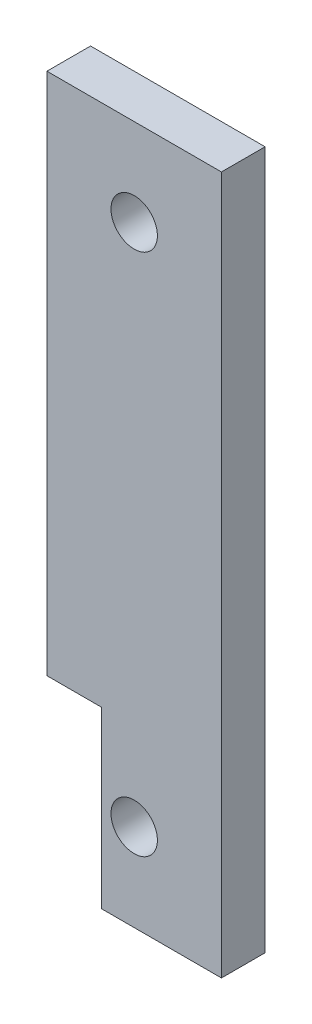
ISO-10303-21;
HEADER;
FILE_DESCRIPTION(('STEP AP214'),'2;1');
FILE_NAME('part.step','',(''),(''),'','','');
FILE_SCHEMA(('AUTOMOTIVE_DESIGN { 1 0 10303 214 1 1 1 1 }'));
ENDSEC;
DATA;
#1=APPLICATION_CONTEXT('core data for automotive mechanical design processes');
#2=APPLICATION_PROTOCOL_DEFINITION('international standard','automotive_design',2000,#1);
#3=PRODUCT_CONTEXT('',#1,'mechanical');
#4=PRODUCT('Part','Part','',(#3));
#5=PRODUCT_RELATED_PRODUCT_CATEGORY('part','',(#4));
#6=PRODUCT_DEFINITION_FORMATION('','',#4);
#7=PRODUCT_DEFINITION_CONTEXT('part definition',#1,'design');
#8=PRODUCT_DEFINITION('design','',#6,#7);
#9=PRODUCT_DEFINITION_SHAPE('','',#8);
#10=(LENGTH_UNIT() NAMED_UNIT(*) SI_UNIT(.MILLI.,.METRE.));
#11=(NAMED_UNIT(*) PLANE_ANGLE_UNIT() SI_UNIT($,.RADIAN.));
#12=(NAMED_UNIT(*) SI_UNIT($,.STERADIAN.) SOLID_ANGLE_UNIT());
#13=UNCERTAINTY_MEASURE_WITH_UNIT(LENGTH_MEASURE(1.E-05),#10,'distance_accuracy_value','');
#14=(GEOMETRIC_REPRESENTATION_CONTEXT(3) GLOBAL_UNCERTAINTY_ASSIGNED_CONTEXT((#13)) GLOBAL_UNIT_ASSIGNED_CONTEXT((#10,
#11,#12)) REPRESENTATION_CONTEXT('',''));
#15=CARTESIAN_POINT('',(0.,0.,0.));
#16=DIRECTION('',(0.,0.,1.));
#17=DIRECTION('',(1.,0.,0.));
#18=AXIS2_PLACEMENT_3D('',#15,#16,#17);
#19=CARTESIAN_POINT('',(0.,101.6,0.));
#20=DIRECTION('',(1.,0.,0.));
#21=DIRECTION('',(0.,0.,-1.));
#22=AXIS2_PLACEMENT_3D('',#19,#20,#21);
#23=PLANE('',#22);
#24=DIRECTION('',(0.,-1.,0.));
#25=VECTOR('',#24,1.);
#26=CARTESIAN_POINT('',(0.,101.6,-6.35));
#27=LINE('',#26,#25);
#28=CARTESIAN_POINT('',(0.,101.6,-6.35));
#29=VERTEX_POINT('',#28);
#30=CARTESIAN_POINT('',(0.,25.4,-6.35));
#31=VERTEX_POINT('',#30);
#32=EDGE_CURVE('E110',#29,#31,#27,.T.);
#33=ORIENTED_EDGE('',*,*,#32,.T.);
#34=DIRECTION('',(0.,0.,-1.));
#35=VECTOR('',#34,1.);
#36=CARTESIAN_POINT('',(0.,25.4,0.));
#37=LINE('',#36,#35);
#38=CARTESIAN_POINT('',(0.,25.4,0.));
#39=VERTEX_POINT('',#38);
#40=EDGE_CURVE('E99',#39,#31,#37,.T.);
#41=ORIENTED_EDGE('',*,*,#40,.F.);
#42=DIRECTION('',(0.,-1.,0.));
#43=VECTOR('',#42,1.);
#44=CARTESIAN_POINT('',(0.,101.6,0.));
#45=LINE('',#44,#43);
#46=CARTESIAN_POINT('',(0.,101.6,0.));
#47=VERTEX_POINT('',#46);
#48=EDGE_CURVE('E11',#47,#39,#45,.T.);
#49=ORIENTED_EDGE('',*,*,#48,.F.);
#50=DIRECTION('',(0.,0.,1.));
#51=VECTOR('',#50,1.);
#52=CARTESIAN_POINT('',(0.,101.6,0.));
#53=LINE('',#52,#51);
#54=EDGE_CURVE('E224',#29,#47,#53,.T.);
#55=ORIENTED_EDGE('',*,*,#54,.F.);
#56=EDGE_LOOP('',(#33,#41,#49,#55));
#57=FACE_BOUND('',#56,.T.);
#58=ADVANCED_FACE('F34',(#57),#23,.F.);
#59=CARTESIAN_POINT('',(0.,101.6,0.));
#60=DIRECTION('',(0.,0.,-1.));
#61=DIRECTION('',(-1.,0.,0.));
#62=AXIS2_PLACEMENT_3D('',#59,#60,#61);
#63=PLANE('',#62);
#64=CARTESIAN_POINT('',(12.7,88.9,0.));
#65=DIRECTION('',(0.,0.,1.));
#66=DIRECTION('',(1.,0.,0.));
#67=AXIS2_PLACEMENT_3D('',#64,#65,#66);
#68=CIRCLE('',#67,3.3782);
#69=CARTESIAN_POINT('',(16.0782,88.9,0.));
#70=VERTEX_POINT('',#69);
#71=EDGE_CURVE('E210',#70,#70,#68,.T.);
#72=ORIENTED_EDGE('',*,*,#71,.F.);
#73=EDGE_LOOP('',(#72));
#74=FACE_BOUND('',#73,.T.);
#75=CARTESIAN_POINT('',(12.7,12.7,0.));
#76=DIRECTION('',(0.,0.,1.));
#77=DIRECTION('',(1.,0.,0.));
#78=AXIS2_PLACEMENT_3D('',#75,#76,#77);
#79=CIRCLE('',#78,3.3782);
#80=CARTESIAN_POINT('',(16.0782,12.7,0.));
#81=VERTEX_POINT('',#80);
#82=EDGE_CURVE('E213',#81,#81,#79,.T.);
#83=ORIENTED_EDGE('',*,*,#82,.F.);
#84=EDGE_LOOP('',(#83));
#85=FACE_BOUND('',#84,.T.);
#86=DIRECTION('',(1.,0.,0.));
#87=VECTOR('',#86,1.);
#88=CARTESIAN_POINT('',(0.,25.4,0.));
#89=LINE('',#88,#87);
#90=CARTESIAN_POINT('',(7.9375,25.4,0.));
#91=VERTEX_POINT('',#90);
#92=EDGE_CURVE('E95',#39,#91,#89,.T.);
#93=ORIENTED_EDGE('',*,*,#92,.T.);
#94=DIRECTION('',(0.,-1.,0.));
#95=VECTOR('',#94,1.);
#96=CARTESIAN_POINT('',(7.9375,0.,0.));
#97=LINE('',#96,#95);
#98=CARTESIAN_POINT('',(7.9375,0.,0.));
#99=VERTEX_POINT('',#98);
#100=EDGE_CURVE('E104',#91,#99,#97,.T.);
#101=ORIENTED_EDGE('',*,*,#100,.T.);
#102=DIRECTION('',(1.,0.,0.));
#103=VECTOR('',#102,1.);
#104=CARTESIAN_POINT('',(0.,0.,0.));
#105=LINE('',#104,#103);
#106=CARTESIAN_POINT('',(25.4,0.,0.));
#107=VERTEX_POINT('',#106);
#108=EDGE_CURVE('E223',#99,#107,#105,.T.);
#109=ORIENTED_EDGE('',*,*,#108,.T.);
#110=DIRECTION('',(0.,-1.,0.));
#111=VECTOR('',#110,1.);
#112=CARTESIAN_POINT('',(25.4,101.6,0.));
#113=LINE('',#112,#111);
#114=CARTESIAN_POINT('',(25.4,101.6,0.));
#115=VERTEX_POINT('',#114);
#116=EDGE_CURVE('E41',#115,#107,#113,.T.);
#117=ORIENTED_EDGE('',*,*,#116,.F.);
#118=DIRECTION('',(1.,0.,0.));
#119=VECTOR('',#118,1.);
#120=CARTESIAN_POINT('',(0.,101.6,0.));
#121=LINE('',#120,#119);
#122=EDGE_CURVE('E80',#47,#115,#121,.T.);
#123=ORIENTED_EDGE('',*,*,#122,.F.);
#124=ORIENTED_EDGE('',*,*,#48,.T.);
#125=EDGE_LOOP('',(#93,#101,#109,#117,#123,#124));
#126=FACE_BOUND('',#125,.T.);
#127=ADVANCED_FACE('F112',(#74,#85,#126),#63,.F.);
#128=CARTESIAN_POINT('',(25.4,101.6,0.));
#129=DIRECTION('',(-1.,0.,0.));
#130=DIRECTION('',(0.,0.,1.));
#131=AXIS2_PLACEMENT_3D('',#128,#129,#130);
#132=PLANE('',#131);
#133=DIRECTION('',(0.,0.,-1.));
#134=VECTOR('',#133,1.);
#135=CARTESIAN_POINT('',(25.4,0.,0.));
#136=LINE('',#135,#134);
#137=CARTESIAN_POINT('',(25.4,0.,-6.35));
#138=VERTEX_POINT('',#137);
#139=EDGE_CURVE('E73',#107,#138,#136,.T.);
#140=ORIENTED_EDGE('',*,*,#139,.T.);
#141=DIRECTION('',(0.,-1.,0.));
#142=VECTOR('',#141,1.);
#143=CARTESIAN_POINT('',(25.4,101.6,-6.35));
#144=LINE('',#143,#142);
#145=CARTESIAN_POINT('',(25.4,101.6,-6.35));
#146=VERTEX_POINT('',#145);
#147=EDGE_CURVE('E236',#146,#138,#144,.T.);
#148=ORIENTED_EDGE('',*,*,#147,.F.);
#149=DIRECTION('',(0.,0.,-1.));
#150=VECTOR('',#149,1.);
#151=CARTESIAN_POINT('',(25.4,101.6,0.));
#152=LINE('',#151,#150);
#153=EDGE_CURVE('E228',#115,#146,#152,.T.);
#154=ORIENTED_EDGE('',*,*,#153,.F.);
#155=ORIENTED_EDGE('',*,*,#116,.T.);
#156=EDGE_LOOP('',(#140,#148,#154,#155));
#157=FACE_BOUND('',#156,.T.);
#158=ADVANCED_FACE('F114',(#157),#132,.F.);
#159=CARTESIAN_POINT('',(0.,101.6,-6.35));
#160=DIRECTION('',(0.,0.,1.));
#161=DIRECTION('',(1.,0.,0.));
#162=AXIS2_PLACEMENT_3D('',#159,#160,#161);
#163=PLANE('',#162);
#164=CARTESIAN_POINT('',(12.7,88.9,-6.35));
#165=DIRECTION('',(0.,0.,1.));
#166=DIRECTION('',(1.,0.,0.));
#167=AXIS2_PLACEMENT_3D('',#164,#165,#166);
#168=CIRCLE('',#167,3.3782);
#169=CARTESIAN_POINT('',(16.0782,88.9,-6.35));
#170=VERTEX_POINT('',#169);
#171=EDGE_CURVE('E208',#170,#170,#168,.T.);
#172=ORIENTED_EDGE('',*,*,#171,.T.);
#173=EDGE_LOOP('',(#172));
#174=FACE_BOUND('',#173,.T.);
#175=CARTESIAN_POINT('',(12.7,12.7,-6.35));
#176=DIRECTION('',(0.,0.,1.));
#177=DIRECTION('',(1.,0.,0.));
#178=AXIS2_PLACEMENT_3D('',#175,#176,#177);
#179=CIRCLE('',#178,3.3782);
#180=CARTESIAN_POINT('',(16.0782,12.7,-6.35));
#181=VERTEX_POINT('',#180);
#182=EDGE_CURVE('E220',#181,#181,#179,.T.);
#183=ORIENTED_EDGE('',*,*,#182,.T.);
#184=EDGE_LOOP('',(#183));
#185=FACE_BOUND('',#184,.T.);
#186=DIRECTION('',(-1.,0.,0.));
#187=VECTOR('',#186,1.);
#188=CARTESIAN_POINT('',(0.,0.,-6.35));
#189=LINE('',#188,#187);
#190=CARTESIAN_POINT('',(7.9375,0.,-6.35));
#191=VERTEX_POINT('',#190);
#192=EDGE_CURVE('E226',#138,#191,#189,.T.);
#193=ORIENTED_EDGE('',*,*,#192,.T.);
#194=DIRECTION('',(0.,-1.,0.));
#195=VECTOR('',#194,1.);
#196=CARTESIAN_POINT('',(7.9375,0.,-6.35));
#197=LINE('',#196,#195);
#198=CARTESIAN_POINT('',(7.9375,25.4,-6.35));
#199=VERTEX_POINT('',#198);
#200=EDGE_CURVE('E48',#199,#191,#197,.T.);
#201=ORIENTED_EDGE('',*,*,#200,.F.);
#202=DIRECTION('',(1.,0.,0.));
#203=VECTOR('',#202,1.);
#204=CARTESIAN_POINT('',(0.,25.4,-6.35));
#205=LINE('',#204,#203);
#206=EDGE_CURVE('E241',#31,#199,#205,.T.);
#207=ORIENTED_EDGE('',*,*,#206,.F.);
#208=ORIENTED_EDGE('',*,*,#32,.F.);
#209=DIRECTION('',(-1.,0.,0.));
#210=VECTOR('',#209,1.);
#211=CARTESIAN_POINT('',(0.,101.6,-6.35));
#212=LINE('',#211,#210);
#213=EDGE_CURVE('E57',#146,#29,#212,.T.);
#214=ORIENTED_EDGE('',*,*,#213,.F.);
#215=ORIENTED_EDGE('',*,*,#147,.T.);
#216=EDGE_LOOP('',(#193,#201,#207,#208,#214,#215));
#217=FACE_BOUND('',#216,.T.);
#218=ADVANCED_FACE('F120',(#174,#185,#217),#163,.F.);
#219=CARTESIAN_POINT('',(0.,101.6,0.));
#220=DIRECTION('',(0.,-1.,0.));
#221=DIRECTION('',(0.,0.,-1.));
#222=AXIS2_PLACEMENT_3D('',#219,#220,#221);
#223=PLANE('',#222);
#224=ORIENTED_EDGE('',*,*,#54,.T.);
#225=ORIENTED_EDGE('',*,*,#122,.T.);
#226=ORIENTED_EDGE('',*,*,#153,.T.);
#227=ORIENTED_EDGE('',*,*,#213,.T.);
#228=EDGE_LOOP('',(#224,#225,#226,#227));
#229=FACE_BOUND('',#228,.T.);
#230=ADVANCED_FACE('F127',(#229),#223,.F.);
#231=CARTESIAN_POINT('',(0.,0.,0.));
#232=DIRECTION('',(0.,-1.,0.));
#233=DIRECTION('',(0.,0.,-1.));
#234=AXIS2_PLACEMENT_3D('',#231,#232,#233);
#235=PLANE('',#234);
#236=DIRECTION('',(0.,0.,-1.));
#237=VECTOR('',#236,1.);
#238=CARTESIAN_POINT('',(7.9375,0.,0.));
#239=LINE('',#238,#237);
#240=EDGE_CURVE('E211',#99,#191,#239,.T.);
#241=ORIENTED_EDGE('',*,*,#240,.T.);
#242=ORIENTED_EDGE('',*,*,#192,.F.);
#243=ORIENTED_EDGE('',*,*,#139,.F.);
#244=ORIENTED_EDGE('',*,*,#108,.F.);
#245=EDGE_LOOP('',(#241,#242,#243,#244));
#246=FACE_BOUND('',#245,.T.);
#247=ADVANCED_FACE('F129',(#246),#235,.T.);
#248=CARTESIAN_POINT('',(12.7,12.7,0.));
#249=DIRECTION('',(0.,0.,1.));
#250=DIRECTION('',(1.,0.,0.));
#251=AXIS2_PLACEMENT_3D('',#248,#249,#250);
#252=CYLINDRICAL_SURFACE('',#251,3.3782);
#253=ORIENTED_EDGE('',*,*,#182,.F.);
#254=EDGE_LOOP('',(#253));
#255=FACE_BOUND('',#254,.T.);
#256=ORIENTED_EDGE('',*,*,#82,.T.);
#257=EDGE_LOOP('',(#256));
#258=FACE_BOUND('',#257,.T.);
#259=ADVANCED_FACE('F132',(#255,#258),#252,.F.);
#260=CARTESIAN_POINT('',(12.7,88.9,0.));
#261=DIRECTION('',(0.,0.,1.));
#262=DIRECTION('',(1.,0.,0.));
#263=AXIS2_PLACEMENT_3D('',#260,#261,#262);
#264=CYLINDRICAL_SURFACE('',#263,3.3782);
#265=ORIENTED_EDGE('',*,*,#171,.F.);
#266=EDGE_LOOP('',(#265));
#267=FACE_BOUND('',#266,.T.);
#268=ORIENTED_EDGE('',*,*,#71,.T.);
#269=EDGE_LOOP('',(#268));
#270=FACE_BOUND('',#269,.T.);
#271=ADVANCED_FACE('F138',(#267,#270),#264,.F.);
#272=CARTESIAN_POINT('',(7.9375,0.,0.));
#273=DIRECTION('',(1.,0.,0.));
#274=DIRECTION('',(0.,1.,0.));
#275=AXIS2_PLACEMENT_3D('',#272,#273,#274);
#276=PLANE('',#275);
#277=ORIENTED_EDGE('',*,*,#200,.T.);
#278=ORIENTED_EDGE('',*,*,#240,.F.);
#279=ORIENTED_EDGE('',*,*,#100,.F.);
#280=DIRECTION('',(0.,0.,-1.));
#281=VECTOR('',#280,1.);
#282=CARTESIAN_POINT('',(7.9375,25.4,0.));
#283=LINE('',#282,#281);
#284=EDGE_CURVE('E101',#91,#199,#283,.T.);
#285=ORIENTED_EDGE('',*,*,#284,.T.);
#286=EDGE_LOOP('',(#277,#278,#279,#285));
#287=FACE_BOUND('',#286,.T.);
#288=ADVANCED_FACE('F142',(#287),#276,.F.);
#289=CARTESIAN_POINT('',(0.,25.4,0.));
#290=DIRECTION('',(0.,1.,0.));
#291=DIRECTION('',(0.,0.,1.));
#292=AXIS2_PLACEMENT_3D('',#289,#290,#291);
#293=PLANE('',#292);
#294=ORIENTED_EDGE('',*,*,#206,.T.);
#295=ORIENTED_EDGE('',*,*,#284,.F.);
#296=ORIENTED_EDGE('',*,*,#92,.F.);
#297=ORIENTED_EDGE('',*,*,#40,.T.);
#298=EDGE_LOOP('',(#294,#295,#296,#297));
#299=FACE_BOUND('',#298,.T.);
#300=ADVANCED_FACE('F98',(#299),#293,.F.);
#301=CLOSED_SHELL('',(#58,#127,#158,#218,#230,#247,#259,#271,#288,#300));
#302=MANIFOLD_SOLID_BREP('B2',#301);
#303=ADVANCED_BREP_SHAPE_REPRESENTATION('',(#18,#302),#14);
#304=SHAPE_DEFINITION_REPRESENTATION(#9,#303);
ENDSEC;
END-ISO-10303-21;
